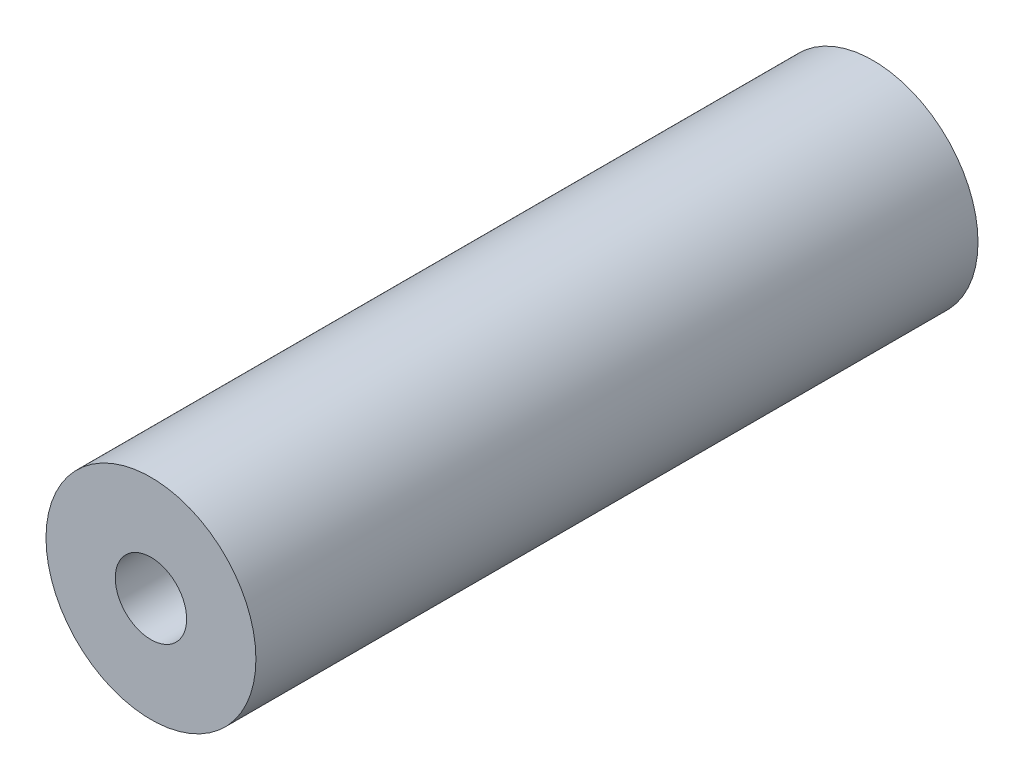
ISO-10303-21;
HEADER;
FILE_DESCRIPTION(('STEP AP214'),'2;1');
FILE_NAME('part.step','',(''),(''),'','','');
FILE_SCHEMA(('AUTOMOTIVE_DESIGN { 1 0 10303 214 1 1 1 1 }'));
ENDSEC;
DATA;
#1=APPLICATION_CONTEXT('core data for automotive mechanical design processes');
#2=APPLICATION_PROTOCOL_DEFINITION('international standard','automotive_design',2000,#1);
#3=PRODUCT_CONTEXT('',#1,'mechanical');
#4=PRODUCT('Part','Part','',(#3));
#5=PRODUCT_RELATED_PRODUCT_CATEGORY('part','',(#4));
#6=PRODUCT_DEFINITION_FORMATION('','',#4);
#7=PRODUCT_DEFINITION_CONTEXT('part definition',#1,'design');
#8=PRODUCT_DEFINITION('design','',#6,#7);
#9=PRODUCT_DEFINITION_SHAPE('','',#8);
#10=(LENGTH_UNIT() NAMED_UNIT(*) SI_UNIT(.MILLI.,.METRE.));
#11=(NAMED_UNIT(*) PLANE_ANGLE_UNIT() SI_UNIT($,.RADIAN.));
#12=(NAMED_UNIT(*) SI_UNIT($,.STERADIAN.) SOLID_ANGLE_UNIT());
#13=UNCERTAINTY_MEASURE_WITH_UNIT(LENGTH_MEASURE(1.E-05),#10,'distance_accuracy_value','');
#14=(GEOMETRIC_REPRESENTATION_CONTEXT(3) GLOBAL_UNCERTAINTY_ASSIGNED_CONTEXT((#13)) GLOBAL_UNIT_ASSIGNED_CONTEXT((#10,
#11,#12)) REPRESENTATION_CONTEXT('',''));
#15=CARTESIAN_POINT('',(0.,0.,0.));
#16=DIRECTION('',(0.,0.,1.));
#17=DIRECTION('',(1.,0.,0.));
#18=AXIS2_PLACEMENT_3D('',#15,#16,#17);
#19=CARTESIAN_POINT('',(0.,0.,0.));
#20=DIRECTION('',(0.,0.,1.));
#21=DIRECTION('',(1.,0.,0.));
#22=AXIS2_PLACEMENT_3D('',#19,#20,#21);
#23=CYLINDRICAL_SURFACE('',#22,12.5);
#24=CARTESIAN_POINT('',(0.,0.,-43.));
#25=DIRECTION('',(0.,0.,1.));
#26=DIRECTION('',(1.,0.,0.));
#27=AXIS2_PLACEMENT_3D('',#24,#25,#26);
#28=CIRCLE('',#27,12.5);
#29=CARTESIAN_POINT('',(12.5,0.,-43.));
#30=VERTEX_POINT('',#29);
#31=EDGE_CURVE('E11',#30,#30,#28,.T.);
#32=ORIENTED_EDGE('',*,*,#31,.T.);
#33=EDGE_LOOP('',(#32));
#34=FACE_BOUND('',#33,.T.);
#35=CARTESIAN_POINT('',(0.,0.,43.));
#36=DIRECTION('',(0.,0.,1.));
#37=DIRECTION('',(1.,0.,0.));
#38=AXIS2_PLACEMENT_3D('',#35,#36,#37);
#39=CIRCLE('',#38,12.5);
#40=CARTESIAN_POINT('',(12.5,0.,43.));
#41=VERTEX_POINT('',#40);
#42=EDGE_CURVE('E61',#41,#41,#39,.T.);
#43=ORIENTED_EDGE('',*,*,#42,.F.);
#44=EDGE_LOOP('',(#43));
#45=FACE_BOUND('',#44,.T.);
#46=ADVANCED_FACE('F38',(#34,#45),#23,.T.);
#47=CARTESIAN_POINT('',(0.,0.,-43.));
#48=DIRECTION('',(0.,0.,1.));
#49=DIRECTION('',(1.,0.,0.));
#50=AXIS2_PLACEMENT_3D('',#47,#48,#49);
#51=PLANE('',#50);
#52=CARTESIAN_POINT('',(0.,0.,-43.));
#53=DIRECTION('',(0.,0.,-1.));
#54=DIRECTION('',(-1.,0.,0.));
#55=AXIS2_PLACEMENT_3D('',#52,#53,#54);
#56=CIRCLE('',#55,4.25);
#57=CARTESIAN_POINT('',(-4.25,0.,-43.));
#58=VERTEX_POINT('',#57);
#59=EDGE_CURVE('E65',#58,#58,#56,.T.);
#60=ORIENTED_EDGE('',*,*,#59,.F.);
#61=EDGE_LOOP('',(#60));
#62=FACE_BOUND('',#61,.T.);
#63=ORIENTED_EDGE('',*,*,#31,.F.);
#64=EDGE_LOOP('',(#63));
#65=FACE_BOUND('',#64,.T.);
#66=ADVANCED_FACE('F82',(#62,#65),#51,.F.);
#67=CARTESIAN_POINT('',(0.,0.,-15.5));
#68=DIRECTION('',(0.,0.,-1.));
#69=DIRECTION('',(-1.,0.,0.));
#70=AXIS2_PLACEMENT_3D('',#67,#68,#69);
#71=CONICAL_SURFACE('',#70,4.24999999999999,1.02974425867665);
#72=CARTESIAN_POINT('',(0.,0.,-12.9463423691328));
#73=VERTEX_POINT('',#72);
#74=VERTEX_LOOP('',#73);
#75=FACE_BOUND('',#74,.T.);
#76=CARTESIAN_POINT('',(0.,0.,-15.5));
#77=DIRECTION('',(0.,0.,-1.));
#78=DIRECTION('',(-1.,0.,0.));
#79=AXIS2_PLACEMENT_3D('',#76,#77,#78);
#80=CIRCLE('',#79,4.24999999999999);
#81=CARTESIAN_POINT('',(-4.24999999999999,0.,-15.5));
#82=VERTEX_POINT('',#81);
#83=EDGE_CURVE('E45',#82,#82,#80,.T.);
#84=ORIENTED_EDGE('',*,*,#83,.T.);
#85=EDGE_LOOP('',(#84));
#86=FACE_BOUND('',#85,.T.);
#87=ADVANCED_FACE('F74',(#75,#86),#71,.F.);
#88=CARTESIAN_POINT('',(0.,0.,-43.));
#89=DIRECTION('',(0.,0.,-1.));
#90=DIRECTION('',(-1.,0.,0.));
#91=AXIS2_PLACEMENT_3D('',#88,#89,#90);
#92=CYLINDRICAL_SURFACE('',#91,4.24999999999999);
#93=ORIENTED_EDGE('',*,*,#83,.F.);
#94=EDGE_LOOP('',(#93));
#95=FACE_BOUND('',#94,.T.);
#96=ORIENTED_EDGE('',*,*,#59,.T.);
#97=EDGE_LOOP('',(#96));
#98=FACE_BOUND('',#97,.T.);
#99=ADVANCED_FACE('F76',(#95,#98),#92,.F.);
#100=CARTESIAN_POINT('',(0.,0.,43.));
#101=DIRECTION('',(0.,0.,-1.));
#102=DIRECTION('',(1.,0.,0.));
#103=AXIS2_PLACEMENT_3D('',#100,#101,#102);
#104=PLANE('',#103);
#105=CARTESIAN_POINT('',(0.,0.,43.));
#106=DIRECTION('',(0.,0.,-1.));
#107=DIRECTION('',(-1.,0.,0.));
#108=AXIS2_PLACEMENT_3D('',#105,#106,#107);
#109=CIRCLE('',#108,4.25);
#110=CARTESIAN_POINT('',(-4.25,0.,43.));
#111=VERTEX_POINT('',#110);
#112=EDGE_CURVE('E62',#111,#111,#109,.T.);
#113=ORIENTED_EDGE('',*,*,#112,.T.);
#114=EDGE_LOOP('',(#113));
#115=FACE_BOUND('',#114,.T.);
#116=ORIENTED_EDGE('',*,*,#42,.T.);
#117=EDGE_LOOP('',(#116));
#118=FACE_BOUND('',#117,.T.);
#119=ADVANCED_FACE('F55',(#115,#118),#104,.F.);
#120=CARTESIAN_POINT('',(0.,0.,15.5));
#121=DIRECTION('',(0.,0.,1.));
#122=DIRECTION('',(-1.,0.,0.));
#123=AXIS2_PLACEMENT_3D('',#120,#121,#122);
#124=CONICAL_SURFACE('',#123,4.24999999999999,1.02974425867665);
#125=CARTESIAN_POINT('',(0.,0.,12.9463423691328));
#126=VERTEX_POINT('',#125);
#127=VERTEX_LOOP('',#126);
#128=FACE_BOUND('',#127,.T.);
#129=CARTESIAN_POINT('',(0.,0.,15.5));
#130=DIRECTION('',(0.,0.,-1.));
#131=DIRECTION('',(-1.,0.,0.));
#132=AXIS2_PLACEMENT_3D('',#129,#130,#131);
#133=CIRCLE('',#132,4.24999999999999);
#134=CARTESIAN_POINT('',(-4.24999999999999,0.,15.5));
#135=VERTEX_POINT('',#134);
#136=EDGE_CURVE('E59',#135,#135,#133,.T.);
#137=ORIENTED_EDGE('',*,*,#136,.F.);
#138=EDGE_LOOP('',(#137));
#139=FACE_BOUND('',#138,.T.);
#140=ADVANCED_FACE('F51',(#128,#139),#124,.F.);
#141=CARTESIAN_POINT('',(0.,0.,43.));
#142=DIRECTION('',(0.,0.,1.));
#143=DIRECTION('',(-1.,0.,0.));
#144=AXIS2_PLACEMENT_3D('',#141,#142,#143);
#145=CYLINDRICAL_SURFACE('',#144,4.24999999999999);
#146=ORIENTED_EDGE('',*,*,#136,.T.);
#147=EDGE_LOOP('',(#146));
#148=FACE_BOUND('',#147,.T.);
#149=ORIENTED_EDGE('',*,*,#112,.F.);
#150=EDGE_LOOP('',(#149));
#151=FACE_BOUND('',#150,.T.);
#152=ADVANCED_FACE('F54',(#148,#151),#145,.F.);
#153=CLOSED_SHELL('',(#46,#66,#87,#99,#119,#140,#152));
#154=MANIFOLD_SOLID_BREP('B2',#153);
#155=ADVANCED_BREP_SHAPE_REPRESENTATION('',(#18,#154),#14);
#156=SHAPE_DEFINITION_REPRESENTATION(#9,#155);
ENDSEC;
END-ISO-10303-21;
